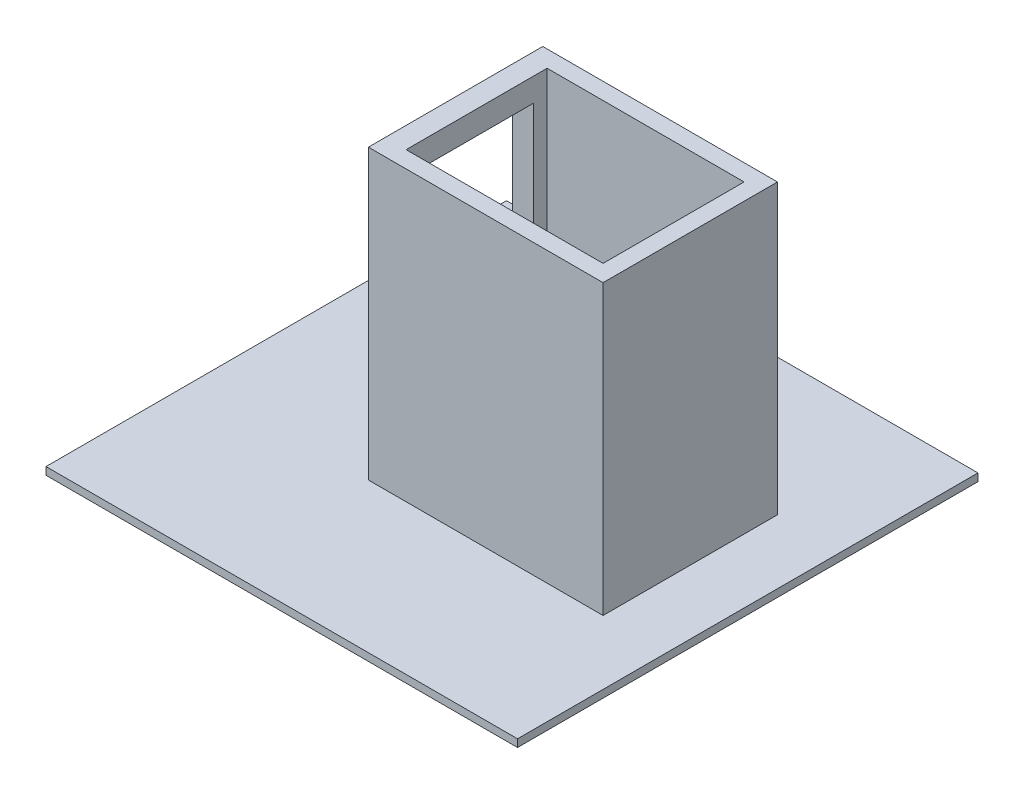
ISO-10303-21;
HEADER;
FILE_DESCRIPTION(('STEP AP214'),'2;1');
FILE_NAME('part.step','',(''),(''),'','','');
FILE_SCHEMA(('AUTOMOTIVE_DESIGN { 1 0 10303 214 1 1 1 1 }'));
ENDSEC;
DATA;
#1=APPLICATION_CONTEXT('core data for automotive mechanical design processes');
#2=APPLICATION_PROTOCOL_DEFINITION('international standard','automotive_design',2000,#1);
#3=PRODUCT_CONTEXT('',#1,'mechanical');
#4=PRODUCT('Part','Part','',(#3));
#5=PRODUCT_RELATED_PRODUCT_CATEGORY('part','',(#4));
#6=PRODUCT_DEFINITION_FORMATION('','',#4);
#7=PRODUCT_DEFINITION_CONTEXT('part definition',#1,'design');
#8=PRODUCT_DEFINITION('design','',#6,#7);
#9=PRODUCT_DEFINITION_SHAPE('','',#8);
#10=(LENGTH_UNIT() NAMED_UNIT(*) SI_UNIT(.MILLI.,.METRE.));
#11=(NAMED_UNIT(*) PLANE_ANGLE_UNIT() SI_UNIT($,.RADIAN.));
#12=(NAMED_UNIT(*) SI_UNIT($,.STERADIAN.) SOLID_ANGLE_UNIT());
#13=UNCERTAINTY_MEASURE_WITH_UNIT(LENGTH_MEASURE(1.E-05),#10,'distance_accuracy_value','');
#14=(GEOMETRIC_REPRESENTATION_CONTEXT(3) GLOBAL_UNCERTAINTY_ASSIGNED_CONTEXT((#13)) GLOBAL_UNIT_ASSIGNED_CONTEXT((#10,
#11,#12)) REPRESENTATION_CONTEXT('',''));
#15=CARTESIAN_POINT('',(0.,0.,0.));
#16=DIRECTION('',(0.,0.,1.));
#17=DIRECTION('',(1.,0.,0.));
#18=AXIS2_PLACEMENT_3D('',#15,#16,#17);
#19=CARTESIAN_POINT('',(0.,0.,0.));
#20=DIRECTION('',(0.,1.,0.));
#21=DIRECTION('',(0.,0.,1.));
#22=AXIS2_PLACEMENT_3D('',#19,#20,#21);
#23=PLANE('',#22);
#24=DIRECTION('',(0.,0.,-1.));
#25=VECTOR('',#24,1.);
#26=CARTESIAN_POINT('',(-1139.27193875429,0.,-899.986661480597));
#27=LINE('',#26,#25);
#28=CARTESIAN_POINT('',(-1139.27193875429,0.,2135.15333791769));
#29=VERTEX_POINT('',#28);
#30=CARTESIAN_POINT('',(-1139.27193875429,0.,-899.986661480597));
#31=VERTEX_POINT('',#30);
#32=EDGE_CURVE('E182',#29,#31,#27,.T.);
#33=ORIENTED_EDGE('',*,*,#32,.F.);
#34=DIRECTION('',(-1.,0.,0.));
#35=VECTOR('',#34,1.);
#36=CARTESIAN_POINT('',(-1139.27193875429,0.,2135.15333791769));
#37=LINE('',#36,#35);
#38=CARTESIAN_POINT('',(1968.63826614631,0.,2135.15333791769));
#39=VERTEX_POINT('',#38);
#40=EDGE_CURVE('E189',#39,#29,#37,.T.);
#41=ORIENTED_EDGE('',*,*,#40,.F.);
#42=DIRECTION('',(0.,0.,1.));
#43=VECTOR('',#42,1.);
#44=CARTESIAN_POINT('',(1968.63826614631,0.,-899.986661480597));
#45=LINE('',#44,#43);
#46=CARTESIAN_POINT('',(1968.63826614631,0.,-899.986661480597));
#47=VERTEX_POINT('',#46);
#48=EDGE_CURVE('E200',#47,#39,#45,.T.);
#49=ORIENTED_EDGE('',*,*,#48,.F.);
#50=DIRECTION('',(1.,0.,0.));
#51=VECTOR('',#50,1.);
#52=CARTESIAN_POINT('',(-1139.27193875429,0.,-899.986661480597));
#53=LINE('',#52,#51);
#54=EDGE_CURVE('E198',#31,#47,#53,.T.);
#55=ORIENTED_EDGE('',*,*,#54,.F.);
#56=EDGE_LOOP('',(#33,#41,#49,#55));
#57=FACE_BOUND('',#56,.T.);
#58=DIRECTION('',(0.,0.,-1.));
#59=VECTOR('',#58,1.);
#60=CARTESIAN_POINT('',(1546.8388080612,0.,1149.47104644896));
#61=LINE('',#60,#59);
#62=CARTESIAN_POINT('',(1546.8388080612,0.,1149.47104644896));
#63=VERTEX_POINT('',#62);
#64=CARTESIAN_POINT('',(1546.8388080612,0.,0.));
#65=VERTEX_POINT('',#64);
#66=EDGE_CURVE('E169',#63,#65,#61,.T.);
#67=ORIENTED_EDGE('',*,*,#66,.F.);
#68=DIRECTION('',(1.,0.,0.));
#69=VECTOR('',#68,1.);
#70=CARTESIAN_POINT('',(0.,0.,1149.47104644896));
#71=LINE('',#70,#69);
#72=CARTESIAN_POINT('',(0.,0.,1149.47104644896));
#73=VERTEX_POINT('',#72);
#74=EDGE_CURVE('E152',#73,#63,#71,.T.);
#75=ORIENTED_EDGE('',*,*,#74,.F.);
#76=DIRECTION('',(0.,0.,1.));
#77=VECTOR('',#76,1.);
#78=CARTESIAN_POINT('',(0.,0.,0.));
#79=LINE('',#78,#77);
#80=CARTESIAN_POINT('',(0.,0.,917.800772956941));
#81=VERTEX_POINT('',#80);
#82=EDGE_CURVE('E232',#81,#73,#79,.T.);
#83=ORIENTED_EDGE('',*,*,#82,.F.);
#84=DIRECTION('',(1.,0.,0.));
#85=VECTOR('',#84,1.);
#86=CARTESIAN_POINT('',(0.,0.,917.800772956941));
#87=LINE('',#86,#85);
#88=CARTESIAN_POINT('',(138.623418893001,0.,917.800772956941));
#89=VERTEX_POINT('',#88);
#90=EDGE_CURVE('E271',#81,#89,#87,.T.);
#91=ORIENTED_EDGE('',*,*,#90,.T.);
#92=DIRECTION('',(0.,0.,1.));
#93=VECTOR('',#92,1.);
#94=CARTESIAN_POINT('',(138.623418893001,0.,110.));
#95=LINE('',#94,#93);
#96=CARTESIAN_POINT('',(138.623418893001,0.,1039.47104644896));
#97=VERTEX_POINT('',#96);
#98=EDGE_CURVE('E250',#89,#97,#95,.T.);
#99=ORIENTED_EDGE('',*,*,#98,.T.);
#100=DIRECTION('',(1.,0.,0.));
#101=VECTOR('',#100,1.);
#102=CARTESIAN_POINT('',(138.623418893001,0.,1039.47104644896));
#103=LINE('',#102,#101);
#104=CARTESIAN_POINT('',(1436.8388080612,0.,1039.47104644896));
#105=VERTEX_POINT('',#104);
#106=EDGE_CURVE('E161',#97,#105,#103,.T.);
#107=ORIENTED_EDGE('',*,*,#106,.T.);
#108=DIRECTION('',(0.,0.,-1.));
#109=VECTOR('',#108,1.);
#110=CARTESIAN_POINT('',(1436.8388080612,0.,0.));
#111=LINE('',#110,#109);
#112=CARTESIAN_POINT('',(1436.8388080612,0.,110.));
#113=VERTEX_POINT('',#112);
#114=EDGE_CURVE('E11',#105,#113,#111,.T.);
#115=ORIENTED_EDGE('',*,*,#114,.T.);
#116=DIRECTION('',(-1.,0.,0.));
#117=VECTOR('',#116,1.);
#118=CARTESIAN_POINT('',(1436.8388080612,0.,110.));
#119=LINE('',#118,#117);
#120=CARTESIAN_POINT('',(138.623418893001,0.,110.));
#121=VERTEX_POINT('',#120);
#122=EDGE_CURVE('E254',#113,#121,#119,.T.);
#123=ORIENTED_EDGE('',*,*,#122,.T.);
#124=CARTESIAN_POINT('',(138.623418893001,0.,200.));
#125=VERTEX_POINT('',#124);
#126=EDGE_CURVE('E251',#121,#125,#95,.T.);
#127=ORIENTED_EDGE('',*,*,#126,.T.);
#128=DIRECTION('',(-1.,0.,0.));
#129=VECTOR('',#128,1.);
#130=CARTESIAN_POINT('',(0.,0.,200.));
#131=LINE('',#130,#129);
#132=CARTESIAN_POINT('',(0.,0.,200.));
#133=VERTEX_POINT('',#132);
#134=EDGE_CURVE('E268',#125,#133,#131,.T.);
#135=ORIENTED_EDGE('',*,*,#134,.T.);
#136=CARTESIAN_POINT('',(0.,0.,0.));
#137=VERTEX_POINT('',#136);
#138=EDGE_CURVE('E162',#137,#133,#79,.T.);
#139=ORIENTED_EDGE('',*,*,#138,.F.);
#140=DIRECTION('',(1.,0.,0.));
#141=VECTOR('',#140,1.);
#142=CARTESIAN_POINT('',(0.,0.,0.));
#143=LINE('',#142,#141);
#144=EDGE_CURVE('E176',#137,#65,#143,.T.);
#145=ORIENTED_EDGE('',*,*,#144,.T.);
#146=EDGE_LOOP('',(#67,#75,#83,#91,#99,#107,#115,#123,#127,#135,#139,#145));
#147=FACE_BOUND('',#146,.T.);
#148=ADVANCED_FACE('F36',(#57,#147),#23,.T.);
#149=CARTESIAN_POINT('',(0.,1900.,0.));
#150=DIRECTION('',(1.,0.,0.));
#151=DIRECTION('',(0.,0.,-1.));
#152=AXIS2_PLACEMENT_3D('',#149,#150,#151);
#153=PLANE('',#152);
#154=DIRECTION('',(0.,0.,-1.));
#155=VECTOR('',#154,1.);
#156=CARTESIAN_POINT('',(0.,1745.38768512421,200.));
#157=LINE('',#156,#155);
#158=CARTESIAN_POINT('',(0.,1745.38768512421,917.800772956941));
#159=VERTEX_POINT('',#158);
#160=CARTESIAN_POINT('',(0.,1745.38768512421,200.));
#161=VERTEX_POINT('',#160);
#162=EDGE_CURVE('E217',#159,#161,#157,.T.);
#163=ORIENTED_EDGE('',*,*,#162,.F.);
#164=DIRECTION('',(0.,1.,0.));
#165=VECTOR('',#164,1.);
#166=CARTESIAN_POINT('',(0.,1745.38768512421,917.800772956941));
#167=LINE('',#166,#165);
#168=EDGE_CURVE('E214',#81,#159,#167,.T.);
#169=ORIENTED_EDGE('',*,*,#168,.F.);
#170=ORIENTED_EDGE('',*,*,#82,.T.);
#171=DIRECTION('',(0.,-1.,0.));
#172=VECTOR('',#171,1.);
#173=CARTESIAN_POINT('',(0.,1900.,1149.47104644896));
#174=LINE('',#173,#172);
#175=CARTESIAN_POINT('',(0.,1900.,1149.47104644896));
#176=VERTEX_POINT('',#175);
#177=EDGE_CURVE('E157',#176,#73,#174,.T.);
#178=ORIENTED_EDGE('',*,*,#177,.F.);
#179=DIRECTION('',(0.,0.,1.));
#180=VECTOR('',#179,1.);
#181=CARTESIAN_POINT('',(0.,1900.,0.));
#182=LINE('',#181,#180);
#183=CARTESIAN_POINT('',(0.,1900.,0.));
#184=VERTEX_POINT('',#183);
#185=EDGE_CURVE('E233',#184,#176,#182,.T.);
#186=ORIENTED_EDGE('',*,*,#185,.F.);
#187=DIRECTION('',(0.,-1.,0.));
#188=VECTOR('',#187,1.);
#189=CARTESIAN_POINT('',(0.,1900.,0.));
#190=LINE('',#189,#188);
#191=EDGE_CURVE('E53',#184,#137,#190,.T.);
#192=ORIENTED_EDGE('',*,*,#191,.T.);
#193=ORIENTED_EDGE('',*,*,#138,.T.);
#194=DIRECTION('',(0.,-1.,0.));
#195=VECTOR('',#194,1.);
#196=CARTESIAN_POINT('',(0.,-4.94199783350525,200.));
#197=LINE('',#196,#195);
#198=EDGE_CURVE('E220',#161,#133,#197,.T.);
#199=ORIENTED_EDGE('',*,*,#198,.F.);
#200=EDGE_LOOP('',(#163,#169,#170,#178,#186,#192,#193,#199));
#201=FACE_BOUND('',#200,.T.);
#202=ADVANCED_FACE('F38',(#201),#153,.F.);
#203=CARTESIAN_POINT('',(0.,1900.,1149.47104644896));
#204=DIRECTION('',(0.,0.,-1.));
#205=DIRECTION('',(-1.,0.,0.));
#206=AXIS2_PLACEMENT_3D('',#203,#204,#205);
#207=PLANE('',#206);
#208=ORIENTED_EDGE('',*,*,#74,.T.);
#209=DIRECTION('',(0.,-1.,0.));
#210=VECTOR('',#209,1.);
#211=CARTESIAN_POINT('',(1546.8388080612,1900.,1149.47104644896));
#212=LINE('',#211,#210);
#213=CARTESIAN_POINT('',(1546.8388080612,1900.,1149.47104644896));
#214=VERTEX_POINT('',#213);
#215=EDGE_CURVE('E155',#214,#63,#212,.T.);
#216=ORIENTED_EDGE('',*,*,#215,.F.);
#217=DIRECTION('',(1.,0.,0.));
#218=VECTOR('',#217,1.);
#219=CARTESIAN_POINT('',(0.,1900.,1149.47104644896));
#220=LINE('',#219,#218);
#221=EDGE_CURVE('E85',#176,#214,#220,.T.);
#222=ORIENTED_EDGE('',*,*,#221,.F.);
#223=ORIENTED_EDGE('',*,*,#177,.T.);
#224=EDGE_LOOP('',(#208,#216,#222,#223));
#225=FACE_BOUND('',#224,.T.);
#226=ADVANCED_FACE('F154',(#225),#207,.F.);
#227=CARTESIAN_POINT('',(138.623418893001,1900.,1039.47104644896));
#228=DIRECTION('',(0.,0.,-1.));
#229=DIRECTION('',(-1.,0.,0.));
#230=AXIS2_PLACEMENT_3D('',#227,#228,#229);
#231=PLANE('',#230);
#232=ORIENTED_EDGE('',*,*,#106,.F.);
#233=DIRECTION('',(0.,-1.,0.));
#234=VECTOR('',#233,1.);
#235=CARTESIAN_POINT('',(138.623418893001,1900.,1039.47104644896));
#236=LINE('',#235,#234);
#237=CARTESIAN_POINT('',(138.623418893001,1900.,1039.47104644896));
#238=VERTEX_POINT('',#237);
#239=EDGE_CURVE('E262',#238,#97,#236,.T.);
#240=ORIENTED_EDGE('',*,*,#239,.F.);
#241=DIRECTION('',(1.,0.,0.));
#242=VECTOR('',#241,1.);
#243=CARTESIAN_POINT('',(138.623418893001,1900.,1039.47104644896));
#244=LINE('',#243,#242);
#245=CARTESIAN_POINT('',(1436.8388080612,1900.,1039.47104644896));
#246=VERTEX_POINT('',#245);
#247=EDGE_CURVE('E236',#238,#246,#244,.T.);
#248=ORIENTED_EDGE('',*,*,#247,.T.);
#249=DIRECTION('',(0.,-1.,0.));
#250=VECTOR('',#249,1.);
#251=CARTESIAN_POINT('',(1436.8388080612,1900.,1039.47104644896));
#252=LINE('',#251,#250);
#253=EDGE_CURVE('E264',#246,#105,#252,.T.);
#254=ORIENTED_EDGE('',*,*,#253,.T.);
#255=EDGE_LOOP('',(#232,#240,#248,#254));
#256=FACE_BOUND('',#255,.T.);
#257=ADVANCED_FACE('F309',(#256),#231,.T.);
#258=CARTESIAN_POINT('',(138.623418893001,1900.,110.));
#259=DIRECTION('',(1.,0.,0.));
#260=DIRECTION('',(0.,0.,-1.));
#261=AXIS2_PLACEMENT_3D('',#258,#259,#260);
#262=PLANE('',#261);
#263=DIRECTION('',(0.,-1.,0.));
#264=VECTOR('',#263,1.);
#265=CARTESIAN_POINT('',(138.623418893001,1900.,917.800772956941));
#266=LINE('',#265,#264);
#267=CARTESIAN_POINT('',(138.623418893001,1745.38768512421,917.800772956941));
#268=VERTEX_POINT('',#267);
#269=EDGE_CURVE('E229',#268,#89,#266,.T.);
#270=ORIENTED_EDGE('',*,*,#269,.F.);
#271=DIRECTION('',(0.,0.,1.));
#272=VECTOR('',#271,1.);
#273=CARTESIAN_POINT('',(138.623418893001,1745.38768512421,110.));
#274=LINE('',#273,#272);
#275=CARTESIAN_POINT('',(138.623418893001,1745.38768512421,200.));
#276=VERTEX_POINT('',#275);
#277=EDGE_CURVE('E45',#276,#268,#274,.T.);
#278=ORIENTED_EDGE('',*,*,#277,.F.);
#279=DIRECTION('',(0.,1.,0.));
#280=VECTOR('',#279,1.);
#281=CARTESIAN_POINT('',(138.623418893001,1900.,200.));
#282=LINE('',#281,#280);
#283=EDGE_CURVE('E226',#125,#276,#282,.T.);
#284=ORIENTED_EDGE('',*,*,#283,.F.);
#285=ORIENTED_EDGE('',*,*,#126,.F.);
#286=DIRECTION('',(0.,-1.,0.));
#287=VECTOR('',#286,1.);
#288=CARTESIAN_POINT('',(138.623418893001,1900.,110.));
#289=LINE('',#288,#287);
#290=CARTESIAN_POINT('',(138.623418893001,1900.,110.));
#291=VERTEX_POINT('',#290);
#292=EDGE_CURVE('E260',#291,#121,#289,.T.);
#293=ORIENTED_EDGE('',*,*,#292,.F.);
#294=DIRECTION('',(0.,0.,1.));
#295=VECTOR('',#294,1.);
#296=CARTESIAN_POINT('',(138.623418893001,1900.,110.));
#297=LINE('',#296,#295);
#298=EDGE_CURVE('E239',#291,#238,#297,.T.);
#299=ORIENTED_EDGE('',*,*,#298,.T.);
#300=ORIENTED_EDGE('',*,*,#239,.T.);
#301=ORIENTED_EDGE('',*,*,#98,.F.);
#302=EDGE_LOOP('',(#270,#278,#284,#285,#293,#299,#300,#301));
#303=FACE_BOUND('',#302,.T.);
#304=ADVANCED_FACE('F285',(#303),#262,.T.);
#305=CARTESIAN_POINT('',(1436.8388080612,1900.,110.));
#306=DIRECTION('',(0.,0.,1.));
#307=DIRECTION('',(1.,0.,0.));
#308=AXIS2_PLACEMENT_3D('',#305,#306,#307);
#309=PLANE('',#308);
#310=ORIENTED_EDGE('',*,*,#122,.F.);
#311=DIRECTION('',(0.,-1.,0.));
#312=VECTOR('',#311,1.);
#313=CARTESIAN_POINT('',(1436.8388080612,1900.,110.));
#314=LINE('',#313,#312);
#315=CARTESIAN_POINT('',(1436.8388080612,1900.,110.000000000001));
#316=VERTEX_POINT('',#315);
#317=EDGE_CURVE('E75',#316,#113,#314,.T.);
#318=ORIENTED_EDGE('',*,*,#317,.F.);
#319=DIRECTION('',(-1.,0.,0.));
#320=VECTOR('',#319,1.);
#321=CARTESIAN_POINT('',(1436.8388080612,1900.,110.));
#322=LINE('',#321,#320);
#323=EDGE_CURVE('E242',#316,#291,#322,.T.);
#324=ORIENTED_EDGE('',*,*,#323,.T.);
#325=ORIENTED_EDGE('',*,*,#292,.T.);
#326=EDGE_LOOP('',(#310,#318,#324,#325));
#327=FACE_BOUND('',#326,.T.);
#328=ADVANCED_FACE('F300',(#327),#309,.T.);
#329=CARTESIAN_POINT('',(0.,1900.,0.));
#330=DIRECTION('',(0.,0.,-1.));
#331=DIRECTION('',(-1.,0.,0.));
#332=AXIS2_PLACEMENT_3D('',#329,#330,#331);
#333=PLANE('',#332);
#334=ORIENTED_EDGE('',*,*,#144,.F.);
#335=ORIENTED_EDGE('',*,*,#191,.F.);
#336=DIRECTION('',(1.,0.,0.));
#337=VECTOR('',#336,1.);
#338=CARTESIAN_POINT('',(0.,1900.,0.));
#339=LINE('',#338,#337);
#340=CARTESIAN_POINT('',(1546.8388080612,1900.,0.));
#341=VERTEX_POINT('',#340);
#342=EDGE_CURVE('E245',#184,#341,#339,.T.);
#343=ORIENTED_EDGE('',*,*,#342,.T.);
#344=DIRECTION('',(0.,1.,0.));
#345=VECTOR('',#344,1.);
#346=CARTESIAN_POINT('',(1546.8388080612,1900.,0.));
#347=LINE('',#346,#345);
#348=EDGE_CURVE('E177',#65,#341,#347,.T.);
#349=ORIENTED_EDGE('',*,*,#348,.F.);
#350=EDGE_LOOP('',(#334,#335,#343,#349));
#351=FACE_BOUND('',#350,.T.);
#352=ADVANCED_FACE('F302',(#351),#333,.T.);
#353=CARTESIAN_POINT('',(0.,1900.,0.));
#354=DIRECTION('',(0.,1.,0.));
#355=DIRECTION('',(0.,0.,1.));
#356=AXIS2_PLACEMENT_3D('',#353,#354,#355);
#357=PLANE('',#356);
#358=DIRECTION('',(0.,0.,1.));
#359=VECTOR('',#358,1.);
#360=CARTESIAN_POINT('',(1436.8388080612,1900.,1149.47104644896));
#361=LINE('',#360,#359);
#362=EDGE_CURVE('E173',#316,#246,#361,.T.);
#363=ORIENTED_EDGE('',*,*,#362,.T.);
#364=ORIENTED_EDGE('',*,*,#247,.F.);
#365=ORIENTED_EDGE('',*,*,#298,.F.);
#366=ORIENTED_EDGE('',*,*,#323,.F.);
#367=EDGE_LOOP('',(#363,#364,#365,#366));
#368=FACE_BOUND('',#367,.T.);
#369=ORIENTED_EDGE('',*,*,#185,.T.);
#370=ORIENTED_EDGE('',*,*,#221,.T.);
#371=DIRECTION('',(0.,0.,1.));
#372=VECTOR('',#371,1.);
#373=CARTESIAN_POINT('',(1546.8388080612,1900.,1149.47104644896));
#374=LINE('',#373,#372);
#375=EDGE_CURVE('E172',#341,#214,#374,.T.);
#376=ORIENTED_EDGE('',*,*,#375,.F.);
#377=ORIENTED_EDGE('',*,*,#342,.F.);
#378=EDGE_LOOP('',(#369,#370,#376,#377));
#379=FACE_BOUND('',#378,.T.);
#380=ADVANCED_FACE('F298',(#368,#379),#357,.T.);
#381=CARTESIAN_POINT('',(1900.,1745.38768512421,917.800772956941));
#382=DIRECTION('',(0.,0.,1.));
#383=DIRECTION('',(1.,0.,0.));
#384=AXIS2_PLACEMENT_3D('',#381,#382,#383);
#385=PLANE('',#384);
#386=ORIENTED_EDGE('',*,*,#269,.T.);
#387=ORIENTED_EDGE('',*,*,#90,.F.);
#388=ORIENTED_EDGE('',*,*,#168,.T.);
#389=DIRECTION('',(-1.,0.,0.));
#390=VECTOR('',#389,1.);
#391=CARTESIAN_POINT('',(1900.,1745.38768512421,917.800772956941));
#392=LINE('',#391,#390);
#393=EDGE_CURVE('E223',#268,#159,#392,.T.);
#394=ORIENTED_EDGE('',*,*,#393,.F.);
#395=EDGE_LOOP('',(#386,#387,#388,#394));
#396=FACE_BOUND('',#395,.T.);
#397=ADVANCED_FACE('F282',(#396),#385,.F.);
#398=CARTESIAN_POINT('',(1900.,-4.94199783350525,200.));
#399=DIRECTION('',(0.,0.,-1.));
#400=DIRECTION('',(-1.,0.,0.));
#401=AXIS2_PLACEMENT_3D('',#398,#399,#400);
#402=PLANE('',#401);
#403=ORIENTED_EDGE('',*,*,#283,.T.);
#404=DIRECTION('',(-1.,0.,0.));
#405=VECTOR('',#404,1.);
#406=CARTESIAN_POINT('',(1900.,1745.38768512421,200.));
#407=LINE('',#406,#405);
#408=EDGE_CURVE('E224',#276,#161,#407,.T.);
#409=ORIENTED_EDGE('',*,*,#408,.T.);
#410=ORIENTED_EDGE('',*,*,#198,.T.);
#411=ORIENTED_EDGE('',*,*,#134,.F.);
#412=EDGE_LOOP('',(#403,#409,#410,#411));
#413=FACE_BOUND('',#412,.T.);
#414=ADVANCED_FACE('F290',(#413),#402,.F.);
#415=CARTESIAN_POINT('',(1900.,1745.38768512421,200.));
#416=DIRECTION('',(0.,1.,0.));
#417=DIRECTION('',(0.,0.,1.));
#418=AXIS2_PLACEMENT_3D('',#415,#416,#417);
#419=PLANE('',#418);
#420=ORIENTED_EDGE('',*,*,#277,.T.);
#421=ORIENTED_EDGE('',*,*,#393,.T.);
#422=ORIENTED_EDGE('',*,*,#162,.T.);
#423=ORIENTED_EDGE('',*,*,#408,.F.);
#424=EDGE_LOOP('',(#420,#421,#422,#423));
#425=FACE_BOUND('',#424,.T.);
#426=ADVANCED_FACE('F277',(#425),#419,.F.);
#427=CARTESIAN_POINT('',(-1139.27193875429,-50.,-899.986661480597));
#428=DIRECTION('',(1.,0.,0.));
#429=DIRECTION('',(0.,0.,-1.));
#430=AXIS2_PLACEMENT_3D('',#427,#428,#429);
#431=PLANE('',#430);
#432=ORIENTED_EDGE('',*,*,#32,.T.);
#433=DIRECTION('',(0.,1.,0.));
#434=VECTOR('',#433,1.);
#435=CARTESIAN_POINT('',(-1139.27193875429,-50.,-899.986661480597));
#436=LINE('',#435,#434);
#437=CARTESIAN_POINT('',(-1139.27193875429,-50.,-899.986661480597));
#438=VERTEX_POINT('',#437);
#439=EDGE_CURVE('E211',#438,#31,#436,.T.);
#440=ORIENTED_EDGE('',*,*,#439,.F.);
#441=DIRECTION('',(0.,0.,-1.));
#442=VECTOR('',#441,1.);
#443=CARTESIAN_POINT('',(-1139.27193875429,-50.,-899.986661480597));
#444=LINE('',#443,#442);
#445=CARTESIAN_POINT('',(-1139.27193875429,-50.,2135.15333791769));
#446=VERTEX_POINT('',#445);
#447=EDGE_CURVE('E185',#446,#438,#444,.T.);
#448=ORIENTED_EDGE('',*,*,#447,.F.);
#449=DIRECTION('',(0.,1.,0.));
#450=VECTOR('',#449,1.);
#451=CARTESIAN_POINT('',(-1139.27193875429,-50.,2135.15333791769));
#452=LINE('',#451,#450);
#453=EDGE_CURVE('E195',#446,#29,#452,.T.);
#454=ORIENTED_EDGE('',*,*,#453,.T.);
#455=EDGE_LOOP('',(#432,#440,#448,#454));
#456=FACE_BOUND('',#455,.T.);
#457=ADVANCED_FACE('F333',(#456),#431,.F.);
#458=CARTESIAN_POINT('',(-1139.27193875429,-50.,-899.986661480597));
#459=DIRECTION('',(0.,0.,1.));
#460=DIRECTION('',(1.,0.,0.));
#461=AXIS2_PLACEMENT_3D('',#458,#459,#460);
#462=PLANE('',#461);
#463=ORIENTED_EDGE('',*,*,#54,.T.);
#464=DIRECTION('',(0.,1.,0.));
#465=VECTOR('',#464,1.);
#466=CARTESIAN_POINT('',(1968.63826614631,-50.,-899.986661480597));
#467=LINE('',#466,#465);
#468=CARTESIAN_POINT('',(1968.63826614631,-50.,-899.986661480597));
#469=VERTEX_POINT('',#468);
#470=EDGE_CURVE('E208',#469,#47,#467,.T.);
#471=ORIENTED_EDGE('',*,*,#470,.F.);
#472=DIRECTION('',(1.,0.,0.));
#473=VECTOR('',#472,1.);
#474=CARTESIAN_POINT('',(-1139.27193875429,-50.,-899.986661480597));
#475=LINE('',#474,#473);
#476=EDGE_CURVE('E188',#438,#469,#475,.T.);
#477=ORIENTED_EDGE('',*,*,#476,.F.);
#478=ORIENTED_EDGE('',*,*,#439,.T.);
#479=EDGE_LOOP('',(#463,#471,#477,#478));
#480=FACE_BOUND('',#479,.T.);
#481=ADVANCED_FACE('F329',(#480),#462,.F.);
#482=CARTESIAN_POINT('',(1968.63826614631,-50.,-899.986661480597));
#483=DIRECTION('',(-1.,0.,0.));
#484=DIRECTION('',(0.,0.,1.));
#485=AXIS2_PLACEMENT_3D('',#482,#483,#484);
#486=PLANE('',#485);
#487=ORIENTED_EDGE('',*,*,#48,.T.);
#488=DIRECTION('',(0.,1.,0.));
#489=VECTOR('',#488,1.);
#490=CARTESIAN_POINT('',(1968.63826614631,-50.,2135.15333791769));
#491=LINE('',#490,#489);
#492=CARTESIAN_POINT('',(1968.63826614631,-50.,2135.15333791769));
#493=VERTEX_POINT('',#492);
#494=EDGE_CURVE('E205',#493,#39,#491,.T.);
#495=ORIENTED_EDGE('',*,*,#494,.F.);
#496=DIRECTION('',(0.,0.,1.));
#497=VECTOR('',#496,1.);
#498=CARTESIAN_POINT('',(1968.63826614631,-50.,-899.986661480597));
#499=LINE('',#498,#497);
#500=EDGE_CURVE('E191',#469,#493,#499,.T.);
#501=ORIENTED_EDGE('',*,*,#500,.F.);
#502=ORIENTED_EDGE('',*,*,#470,.T.);
#503=EDGE_LOOP('',(#487,#495,#501,#502));
#504=FACE_BOUND('',#503,.T.);
#505=ADVANCED_FACE('F325',(#504),#486,.F.);
#506=CARTESIAN_POINT('',(-1139.27193875429,-50.,2135.15333791769));
#507=DIRECTION('',(0.,0.,-1.));
#508=DIRECTION('',(-1.,0.,0.));
#509=AXIS2_PLACEMENT_3D('',#506,#507,#508);
#510=PLANE('',#509);
#511=ORIENTED_EDGE('',*,*,#40,.T.);
#512=ORIENTED_EDGE('',*,*,#453,.F.);
#513=DIRECTION('',(-1.,0.,0.));
#514=VECTOR('',#513,1.);
#515=CARTESIAN_POINT('',(-1139.27193875429,-50.,2135.15333791769));
#516=LINE('',#515,#514);
#517=EDGE_CURVE('E193',#493,#446,#516,.T.);
#518=ORIENTED_EDGE('',*,*,#517,.F.);
#519=ORIENTED_EDGE('',*,*,#494,.T.);
#520=EDGE_LOOP('',(#511,#512,#518,#519));
#521=FACE_BOUND('',#520,.T.);
#522=ADVANCED_FACE('F322',(#521),#510,.F.);
#523=CARTESIAN_POINT('',(0.,-50.,0.));
#524=DIRECTION('',(0.,1.,0.));
#525=DIRECTION('',(0.,0.,1.));
#526=AXIS2_PLACEMENT_3D('',#523,#524,#525);
#527=PLANE('',#526);
#528=ORIENTED_EDGE('',*,*,#447,.T.);
#529=ORIENTED_EDGE('',*,*,#476,.T.);
#530=ORIENTED_EDGE('',*,*,#500,.T.);
#531=ORIENTED_EDGE('',*,*,#517,.T.);
#532=EDGE_LOOP('',(#528,#529,#530,#531));
#533=FACE_BOUND('',#532,.T.);
#534=ADVANCED_FACE('F320',(#533),#527,.F.);
#535=CARTESIAN_POINT('',(1546.8388080612,0.,0.));
#536=DIRECTION('',(1.,0.,0.));
#537=DIRECTION('',(0.,0.,-1.));
#538=AXIS2_PLACEMENT_3D('',#535,#536,#537);
#539=PLANE('',#538);
#540=ORIENTED_EDGE('',*,*,#215,.T.);
#541=ORIENTED_EDGE('',*,*,#66,.T.);
#542=ORIENTED_EDGE('',*,*,#348,.T.);
#543=ORIENTED_EDGE('',*,*,#375,.T.);
#544=EDGE_LOOP('',(#540,#541,#542,#543));
#545=FACE_BOUND('',#544,.T.);
#546=ADVANCED_FACE('F167',(#545),#539,.T.);
#547=CARTESIAN_POINT('',(1436.8388080612,0.,0.));
#548=DIRECTION('',(1.,0.,0.));
#549=DIRECTION('',(0.,0.,-1.));
#550=AXIS2_PLACEMENT_3D('',#547,#548,#549);
#551=PLANE('',#550);
#552=ORIENTED_EDGE('',*,*,#253,.F.);
#553=ORIENTED_EDGE('',*,*,#362,.F.);
#554=ORIENTED_EDGE('',*,*,#317,.T.);
#555=ORIENTED_EDGE('',*,*,#114,.F.);
#556=EDGE_LOOP('',(#552,#553,#554,#555));
#557=FACE_BOUND('',#556,.T.);
#558=ADVANCED_FACE('F392',(#557),#551,.F.);
#559=CLOSED_SHELL('',(#148,#202,#226,#257,#304,#328,#352,#380,#397,#414,#426,#457,#481,#505,
#522,#534,#546,#558));
#560=MANIFOLD_SOLID_BREP('B2',#559);
#561=ADVANCED_BREP_SHAPE_REPRESENTATION('',(#18,#560),#14);
#562=SHAPE_DEFINITION_REPRESENTATION(#9,#561);
ENDSEC;
END-ISO-10303-21;
